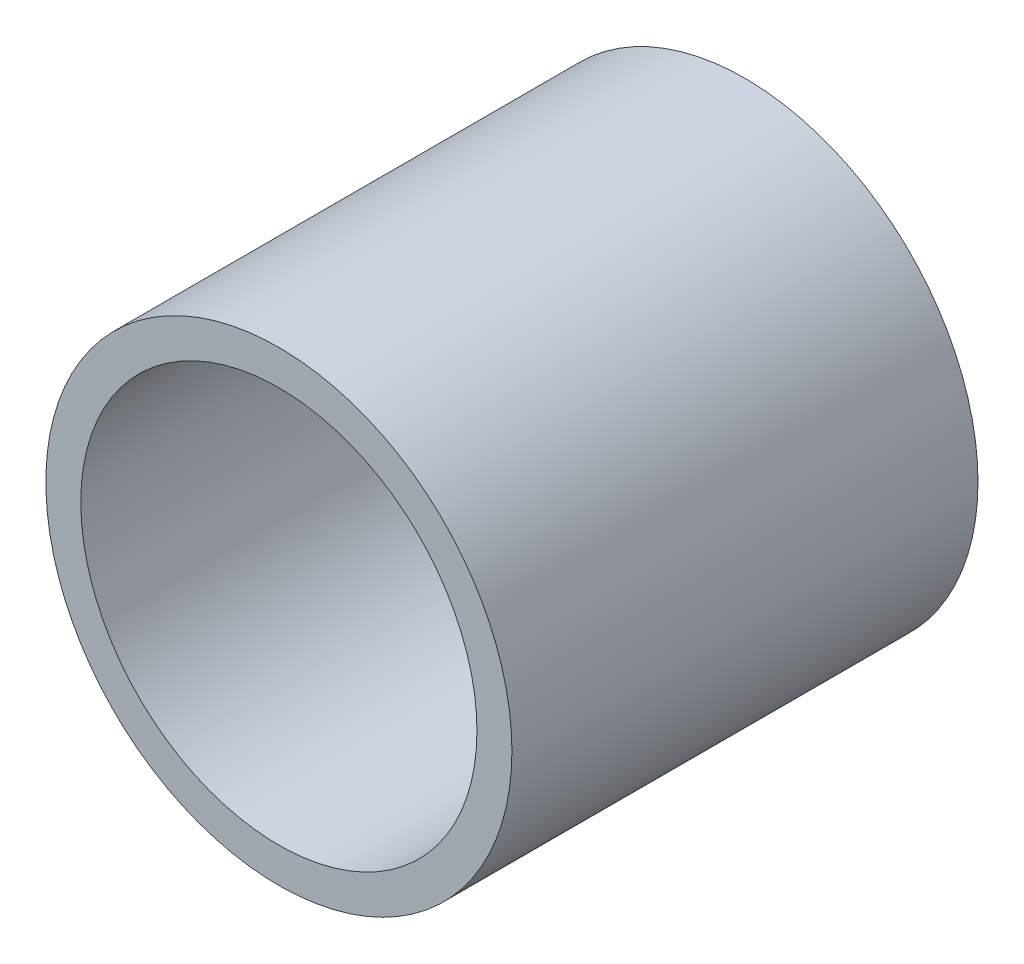
ISO-10303-21;
HEADER;
FILE_DESCRIPTION(('STEP AP214'),'2;1');
FILE_NAME('part.step','',(''),(''),'','','');
FILE_SCHEMA(('AUTOMOTIVE_DESIGN { 1 0 10303 214 1 1 1 1 }'));
ENDSEC;
DATA;
#1=APPLICATION_CONTEXT('core data for automotive mechanical design processes');
#2=APPLICATION_PROTOCOL_DEFINITION('international standard','automotive_design',2000,#1);
#3=PRODUCT_CONTEXT('',#1,'mechanical');
#4=PRODUCT('Part','Part','',(#3));
#5=PRODUCT_RELATED_PRODUCT_CATEGORY('part','',(#4));
#6=PRODUCT_DEFINITION_FORMATION('','',#4);
#7=PRODUCT_DEFINITION_CONTEXT('part definition',#1,'design');
#8=PRODUCT_DEFINITION('design','',#6,#7);
#9=PRODUCT_DEFINITION_SHAPE('','',#8);
#10=(LENGTH_UNIT() NAMED_UNIT(*) SI_UNIT(.MILLI.,.METRE.));
#11=(NAMED_UNIT(*) PLANE_ANGLE_UNIT() SI_UNIT($,.RADIAN.));
#12=(NAMED_UNIT(*) SI_UNIT($,.STERADIAN.) SOLID_ANGLE_UNIT());
#13=UNCERTAINTY_MEASURE_WITH_UNIT(LENGTH_MEASURE(1.E-05),#10,'distance_accuracy_value','');
#14=(GEOMETRIC_REPRESENTATION_CONTEXT(3) GLOBAL_UNCERTAINTY_ASSIGNED_CONTEXT((#13)) GLOBAL_UNIT_ASSIGNED_CONTEXT((#10,
#11,#12)) REPRESENTATION_CONTEXT('',''));
#15=CARTESIAN_POINT('',(0.,0.,0.));
#16=DIRECTION('',(0.,0.,1.));
#17=DIRECTION('',(1.,0.,0.));
#18=AXIS2_PLACEMENT_3D('',#15,#16,#17);
#19=CARTESIAN_POINT('',(-4.52481857713328,16.8872693325153,40.));
#20=DIRECTION('',(0.,0.,-1.));
#21=DIRECTION('',(-1.,0.,0.));
#22=AXIS2_PLACEMENT_3D('',#19,#20,#21);
#23=CYLINDRICAL_SURFACE('',#22,20.);
#24=CARTESIAN_POINT('',(-4.52481857713328,16.8872693325153,40.));
#25=DIRECTION('',(0.,0.,1.));
#26=DIRECTION('',(1.,0.,0.));
#27=AXIS2_PLACEMENT_3D('',#24,#25,#26);
#28=CIRCLE('',#27,20.);
#29=CARTESIAN_POINT('',(15.4751814228667,16.8872693325153,40.));
#30=VERTEX_POINT('',#29);
#31=EDGE_CURVE('E10',#30,#30,#28,.T.);
#32=ORIENTED_EDGE('',*,*,#31,.F.);
#33=EDGE_LOOP('',(#32));
#34=FACE_BOUND('',#33,.T.);
#35=CARTESIAN_POINT('',(-4.52481857713328,16.8872693325153,0.));
#36=DIRECTION('',(0.,0.,1.));
#37=DIRECTION('',(1.,0.,0.));
#38=AXIS2_PLACEMENT_3D('',#35,#36,#37);
#39=CIRCLE('',#38,20.);
#40=CARTESIAN_POINT('',(15.4751814228667,16.8872693325153,0.));
#41=VERTEX_POINT('',#40);
#42=EDGE_CURVE('E46',#41,#41,#39,.T.);
#43=ORIENTED_EDGE('',*,*,#42,.T.);
#44=EDGE_LOOP('',(#43));
#45=FACE_BOUND('',#44,.T.);
#46=ADVANCED_FACE('F43',(#34,#45),#23,.T.);
#47=CARTESIAN_POINT('',(-4.52481857713328,16.8872693325153,40.));
#48=DIRECTION('',(0.,0.,1.));
#49=DIRECTION('',(1.,0.,0.));
#50=AXIS2_PLACEMENT_3D('',#47,#48,#49);
#51=PLANE('',#50);
#52=CARTESIAN_POINT('',(-4.52481857713328,16.8872693325153,40.));
#53=DIRECTION('',(0.,0.,1.));
#54=DIRECTION('',(1.,0.,0.));
#55=AXIS2_PLACEMENT_3D('',#52,#53,#54);
#56=CIRCLE('',#55,17.);
#57=CARTESIAN_POINT('',(12.4751814228667,16.8872693325153,40.));
#58=VERTEX_POINT('',#57);
#59=EDGE_CURVE('E57',#58,#58,#56,.T.);
#60=ORIENTED_EDGE('',*,*,#59,.F.);
#61=EDGE_LOOP('',(#60));
#62=FACE_BOUND('',#61,.T.);
#63=ORIENTED_EDGE('',*,*,#31,.T.);
#64=EDGE_LOOP('',(#63));
#65=FACE_BOUND('',#64,.T.);
#66=ADVANCED_FACE('F74',(#62,#65),#51,.T.);
#67=CARTESIAN_POINT('',(-4.52481857713328,16.8872693325153,0.));
#68=DIRECTION('',(0.,0.,1.));
#69=DIRECTION('',(1.,0.,0.));
#70=AXIS2_PLACEMENT_3D('',#67,#68,#69);
#71=PLANE('',#70);
#72=ORIENTED_EDGE('',*,*,#42,.F.);
#73=EDGE_LOOP('',(#72));
#74=FACE_BOUND('',#73,.T.);
#75=ADVANCED_FACE('F70',(#74),#71,.F.);
#76=CARTESIAN_POINT('',(-4.52481857713328,16.8872693325153,3.));
#77=DIRECTION('',(0.,0.,1.));
#78=DIRECTION('',(1.,0.,0.));
#79=AXIS2_PLACEMENT_3D('',#76,#77,#78);
#80=CYLINDRICAL_SURFACE('',#79,17.);
#81=CARTESIAN_POINT('',(-4.52481857713328,16.8872693325153,3.));
#82=DIRECTION('',(0.,0.,1.));
#83=DIRECTION('',(1.,0.,0.));
#84=AXIS2_PLACEMENT_3D('',#81,#82,#83);
#85=CIRCLE('',#84,17.);
#86=CARTESIAN_POINT('',(12.4751814228667,16.8872693325153,3.));
#87=VERTEX_POINT('',#86);
#88=EDGE_CURVE('E55',#87,#87,#85,.T.);
#89=ORIENTED_EDGE('',*,*,#88,.F.);
#90=EDGE_LOOP('',(#89));
#91=FACE_BOUND('',#90,.T.);
#92=ORIENTED_EDGE('',*,*,#59,.T.);
#93=EDGE_LOOP('',(#92));
#94=FACE_BOUND('',#93,.T.);
#95=ADVANCED_FACE('F67',(#91,#94),#80,.F.);
#96=CARTESIAN_POINT('',(-4.52481857713328,16.8872693325153,3.));
#97=DIRECTION('',(0.,0.,1.));
#98=DIRECTION('',(1.,0.,0.));
#99=AXIS2_PLACEMENT_3D('',#96,#97,#98);
#100=PLANE('',#99);
#101=ORIENTED_EDGE('',*,*,#88,.T.);
#102=EDGE_LOOP('',(#101));
#103=FACE_BOUND('',#102,.T.);
#104=ADVANCED_FACE('F65',(#103),#100,.T.);
#105=CLOSED_SHELL('',(#46,#66,#75,#95,#104));
#106=MANIFOLD_SOLID_BREP('B2',#105);
#107=ADVANCED_BREP_SHAPE_REPRESENTATION('',(#18,#106),#14);
#108=SHAPE_DEFINITION_REPRESENTATION(#9,#107);
ENDSEC;
END-ISO-10303-21;
